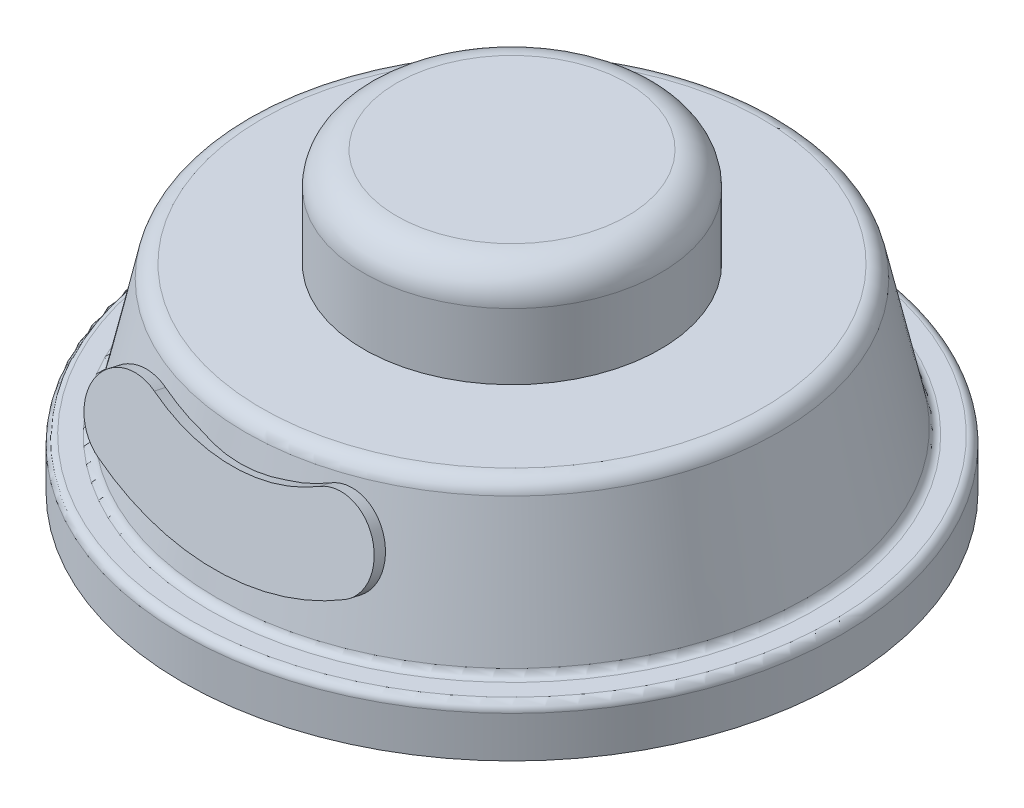
ISO-10303-21;
HEADER;
FILE_DESCRIPTION(('STEP AP214'),'2;1');
FILE_NAME('part.step','',(''),(''),'','','');
FILE_SCHEMA(('AUTOMOTIVE_DESIGN { 1 0 10303 214 1 1 1 1 }'));
ENDSEC;
DATA;
#1=APPLICATION_CONTEXT('core data for automotive mechanical design processes');
#2=APPLICATION_PROTOCOL_DEFINITION('international standard','automotive_design',2000,#1);
#3=PRODUCT_CONTEXT('',#1,'mechanical');
#4=PRODUCT('Part','Part','',(#3));
#5=PRODUCT_RELATED_PRODUCT_CATEGORY('part','',(#4));
#6=PRODUCT_DEFINITION_FORMATION('','',#4);
#7=PRODUCT_DEFINITION_CONTEXT('part definition',#1,'design');
#8=PRODUCT_DEFINITION('design','',#6,#7);
#9=PRODUCT_DEFINITION_SHAPE('','',#8);
#10=(LENGTH_UNIT() NAMED_UNIT(*) SI_UNIT(.MILLI.,.METRE.));
#11=(NAMED_UNIT(*) PLANE_ANGLE_UNIT() SI_UNIT($,.RADIAN.));
#12=(NAMED_UNIT(*) SI_UNIT($,.STERADIAN.) SOLID_ANGLE_UNIT());
#13=UNCERTAINTY_MEASURE_WITH_UNIT(LENGTH_MEASURE(1.E-05),#10,'distance_accuracy_value','');
#14=(GEOMETRIC_REPRESENTATION_CONTEXT(3) GLOBAL_UNCERTAINTY_ASSIGNED_CONTEXT((#13)) GLOBAL_UNIT_ASSIGNED_CONTEXT((#10,
#11,#12)) REPRESENTATION_CONTEXT('',''));
#15=CARTESIAN_POINT('',(0.,0.,0.));
#16=DIRECTION('',(0.,0.,1.));
#17=DIRECTION('',(1.,0.,0.));
#18=AXIS2_PLACEMENT_3D('',#15,#16,#17);
#19=CARTESIAN_POINT('',(0.,12.,0.));
#20=DIRECTION('',(0.,-1.,0.));
#21=DIRECTION('',(1.,0.,0.));
#22=AXIS2_PLACEMENT_3D('',#19,#20,#21);
#23=CONICAL_SURFACE('',#22,16.,0.218668945873942);
#24=CARTESIAN_POINT('',(0.,3.39153477109067,0.));
#25=DIRECTION('',(0.,-1.,0.));
#26=DIRECTION('',(1.,0.,0.));
#27=AXIS2_PLACEMENT_3D('',#24,#25,#26);
#28=CIRCLE('',#27,17.912992273091);
#29=CARTESIAN_POINT('',(17.912992273091,3.39153477109067,0.));
#30=VERTEX_POINT('',#29);
#31=EDGE_CURVE('E190',#30,#30,#28,.F.);
#32=ORIENTED_EDGE('',*,*,#31,.T.);
#33=EDGE_LOOP('',(#32));
#34=FACE_BOUND('',#33,.T.);
#35=CARTESIAN_POINT('',(0.,11.2169304578187,0.));
#36=DIRECTION('',(0.,1.,0.));
#37=DIRECTION('',(-1.,0.,0.));
#38=AXIS2_PLACEMENT_3D('',#35,#36,#37);
#39=CIRCLE('',#38,16.1740154538181);
#40=CARTESIAN_POINT('',(-16.1740154538181,11.2169304578187,0.));
#41=VERTEX_POINT('',#40);
#42=EDGE_CURVE('E174',#41,#41,#39,.F.);
#43=ORIENTED_EDGE('',*,*,#42,.T.);
#44=EDGE_LOOP('',(#43));
#45=FACE_BOUND('',#44,.T.);
#46=CARTESIAN_POINT('',(3.45720686361789,10.2609463358763,16.0176050975695));
#47=CARTESIAN_POINT('',(3.22773095311083,10.190057272501,16.0832826797373));
#48=CARTESIAN_POINT('',(2.99433926794827,10.1260580964333,16.1428638182956));
#49=CARTESIAN_POINT('',(2.52112889680109,10.0123754138582,16.2490494866227));
#50=CARTESIAN_POINT('',(2.28130821784729,9.9626964039865,16.2956499402082));
#51=CARTESIAN_POINT('',(1.79687206709386,9.87824938358092,16.3750348973591));
#52=CARTESIAN_POINT('',(1.55225824257946,9.84347634106428,16.4078240632983));
#53=CARTESIAN_POINT('',(1.05988646044738,9.78921709266682,16.4590498252578));
#54=CARTESIAN_POINT('',(0.812129003227727,9.76972848410186,16.4774886771168));
#55=CARTESIAN_POINT('',(0.314629284028566,9.74623760465022,16.49971950389));
#56=CARTESIAN_POINT('',(0.0648836988721862,9.74227235466804,16.5034764646369));
#57=CARTESIAN_POINT('',(-0.434149809180184,9.74997930873948,16.4961794089411));
#58=CARTESIAN_POINT('',(-0.683437730705828,9.76165155953904,16.485125348223));
#59=CARTESIAN_POINT('',(-1.17936425371395,9.80046197265399,16.4484314125975));
#60=CARTESIAN_POINT('',(-1.42600606172398,9.82757857024579,16.4228118753489));
#61=CARTESIAN_POINT('',(-1.91516139806947,9.89692986377701,16.3574611366622));
#62=CARTESIAN_POINT('',(-2.15767659570617,9.93915828665748,16.3177357907292));
#63=CARTESIAN_POINT('',(-2.57773209827146,10.0259930794598,16.2363423191294));
#64=CARTESIAN_POINT('',(-2.75650776368711,10.0674282324294,16.1975846708006));
#65=CARTESIAN_POINT('',(-3.10998040538967,10.1582705209238,16.1128895087882));
#66=CARTESIAN_POINT('',(-3.28468334005909,10.2076650486565,16.0669633536958));
#67=CARTESIAN_POINT('',(-3.4572068636179,10.2609463358763,16.0176050975695));
#68=B_SPLINE_CURVE_WITH_KNOTS('',3,(#46,#47,#48,#49,#50,#51,#52,#53,#54,#55,#56,#57,#58,#59,#60,
#61,#62,#63,#64,#65,#66,#67),.UNSPECIFIED.,.F.,.F.,(4,2,2,2,2,2,2,2,2,2,4),(0.,
0.746842280338755,1.49391881972158,2.24074296069528,2.98744967878112,3.73593610055249,
4.48442475981529,5.23187086809353,5.97900706377839,6.54135802095914,7.10282680579694),.UNSPECIFIED.);
#69=CARTESIAN_POINT('',(2.5871921997568,10.0296096672216,16.2329857526776));
#70=VERTEX_POINT('',#69);
#71=CARTESIAN_POINT('',(-2.58719219975712,10.0296096672036,16.2329857526816));
#72=VERTEX_POINT('',#71);
#73=EDGE_CURVE('E202',#70,#72,#68,.T.);
#74=ORIENTED_EDGE('',*,*,#73,.F.);
#75=CARTESIAN_POINT('',(2.56620948592745,11.2171304578187,15.969092243656));
#76=CARTESIAN_POINT('',(2.58511617900529,10.1509783472957,16.2060149348833));
#77=CARTESIAN_POINT('',(2.60382682751886,9.08482299252879,16.4429383470538));
#78=CARTESIAN_POINT('',(2.64085603536723,6.95250579739954,16.916786612638));
#79=CARTESIAN_POINT('',(2.65917459470309,5.88634395703725,17.1537114660519));
#80=CARTESIAN_POINT('',(2.67729710947575,4.82017887243097,17.3906370404088));
#81=B_SPLINE_CURVE_WITH_KNOTS('',3,(#75,#76,#77,#78,#79,#80),.UNSPECIFIED.,.F.,.F.,(4,2,4),(0.,
3.27696968080335,6.55393935271583),.UNSPECIFIED.);
#82=CARTESIAN_POINT('',(2.67333632537362,5.0529193591372,17.3389169322519));
#83=VERTEX_POINT('',#82);
#84=EDGE_CURVE('E11',#70,#83,#81,.T.);
#85=ORIENTED_EDGE('',*,*,#84,.T.);
#86=CARTESIAN_POINT('',(4.2295304120463,5.34301452262326,16.9598954433988));
#87=CARTESIAN_POINT('',(4.07347057118977,5.30691978604902,17.0070815601999));
#88=CARTESIAN_POINT('',(3.9162368452015,5.272720761438,17.0517793753009));
#89=CARTESIAN_POINT('',(3.599604741216,5.20822215826845,17.1360632979982));
#90=CARTESIAN_POINT('',(3.44020623589567,5.17792281017995,17.1756491034764));
#91=CARTESIAN_POINT('',(2.95903508901031,5.09303692521042,17.2865350481255));
#92=CARTESIAN_POINT('',(2.63431711137291,5.04446957992441,17.3499545246577));
#93=CARTESIAN_POINT('',(1.97923045692615,4.96416815328296,17.4547939259072));
#94=CARTESIAN_POINT('',(1.64886029403785,4.93243857138287,17.4962079702476));
#95=CARTESIAN_POINT('',(0.984900191580312,4.88634471966051,17.5563657788202));
#96=CARTESIAN_POINT('',(0.651310840074972,4.87197733654552,17.5751136074323));
#97=CARTESIAN_POINT('',(-0.0174115127870188,4.86082933082171,17.5896607655227));
#98=CARTESIAN_POINT('',(-0.352546298536016,4.86408834134669,17.5854083787709));
#99=CARTESIAN_POINT('',(-1.02109826176699,4.88823002751625,17.5539045070141));
#100=CARTESIAN_POINT('',(-1.35451542252561,4.90911287442728,17.5266527985044));
#101=CARTESIAN_POINT('',(-2.01643791533699,4.96808408516178,17.4496802860419));
#102=CARTESIAN_POINT('',(-2.34495237268438,5.00613483151191,17.4000086075522));
#103=CARTESIAN_POINT('',(-2.99543405512699,5.09880780574128,17.2789953690403));
#104=CARTESIAN_POINT('',(-3.31740485730414,5.15342070494255,17.20766600774));
#105=CARTESIAN_POINT('',(-3.73507016406784,5.23554386722165,17.1003614019209));
#106=CARTESIAN_POINT('',(-3.83464346728124,5.2559839889328,17.0736507974475));
#107=CARTESIAN_POINT('',(-4.03280728372045,5.2983721501383,17.0182518288246));
#108=CARTESIAN_POINT('',(-4.13139865229024,5.32031871609019,16.989565397257));
#109=CARTESIAN_POINT('',(-4.22953041204624,5.34301452262324,16.9598954433988));
#110=B_SPLINE_CURVE_WITH_KNOTS('',3,(#86,#87,#88,#89,#90,#91,#92,#93,#94,#95,#96,#97,#98,#99,
#100,#101,#102,#103,#104,#105,#106,#107,#108,#109),.UNSPECIFIED.,.F.,.F.,(4,2,2,2,2,2,2,2,2,2,2,
4),(0.,0.500887924560247,1.00180543790808,2.00373745954932,3.00593708687205,4.00795697866477,
5.01223085820295,6.01651449727399,7.01860820560968,8.02013852694744,8.33541683377483,
8.65039102591891),.UNSPECIFIED.);
#111=CARTESIAN_POINT('',(-2.67333632537362,5.0529193591372,17.3389169322519));
#112=VERTEX_POINT('',#111);
#113=EDGE_CURVE('E58',#83,#112,#110,.T.);
#114=ORIENTED_EDGE('',*,*,#113,.T.);
#115=CARTESIAN_POINT('',(-2.67729710947553,4.82017887243098,17.3906370404088));
#116=CARTESIAN_POINT('',(-2.65917459470295,5.88634395703726,17.1537114660519));
#117=CARTESIAN_POINT('',(-2.64085603536716,6.95250579739955,16.916786612638));
#118=CARTESIAN_POINT('',(-2.60382682751892,9.08482299252879,16.4429383470538));
#119=CARTESIAN_POINT('',(-2.58511617900542,10.1509783472957,16.2060149348833));
#120=CARTESIAN_POINT('',(-2.56620948592763,11.2171304578187,15.969092243656));
#121=B_SPLINE_CURVE_WITH_KNOTS('',3,(#115,#116,#117,#118,#119,#120),.UNSPECIFIED.,.F.,.F.,(4,2,
4),(0.,3.27696967191247,6.55393935271582),.UNSPECIFIED.);
#122=EDGE_CURVE('E194',#112,#72,#121,.T.);
#123=ORIENTED_EDGE('',*,*,#122,.T.);
#124=EDGE_LOOP('',(#74,#85,#114,#123));
#125=FACE_BOUND('',#124,.T.);
#126=ADVANCED_FACE('F43',(#34,#45,#125),#23,.T.);
#127=CARTESIAN_POINT('',(0.,3.,0.));
#128=DIRECTION('',(0.,-1.,0.));
#129=DIRECTION('',(0.,0.,-1.));
#130=AXIS2_PLACEMENT_3D('',#127,#128,#129);
#131=CYLINDRICAL_SURFACE('',#130,20.);
#132=CARTESIAN_POINT('',(0.,2.5,0.));
#133=DIRECTION('',(0.,1.,0.));
#134=DIRECTION('',(0.,0.,1.));
#135=AXIS2_PLACEMENT_3D('',#132,#133,#134);
#136=CIRCLE('',#135,20.);
#137=CARTESIAN_POINT('',(0.,2.5,20.));
#138=VERTEX_POINT('',#137);
#139=EDGE_CURVE('E186',#138,#138,#136,.F.);
#140=ORIENTED_EDGE('',*,*,#139,.T.);
#141=EDGE_LOOP('',(#140));
#142=FACE_BOUND('',#141,.T.);
#143=CARTESIAN_POINT('',(0.,0.,0.));
#144=DIRECTION('',(0.,1.,0.));
#145=DIRECTION('',(0.,0.,1.));
#146=AXIS2_PLACEMENT_3D('',#143,#144,#145);
#147=CIRCLE('',#146,20.);
#148=CARTESIAN_POINT('',(0.,0.,20.));
#149=VERTEX_POINT('',#148);
#150=EDGE_CURVE('E154',#149,#149,#147,.T.);
#151=ORIENTED_EDGE('',*,*,#150,.T.);
#152=EDGE_LOOP('',(#151));
#153=FACE_BOUND('',#152,.T.);
#154=ADVANCED_FACE('F272',(#142,#153),#131,.T.);
#155=CARTESIAN_POINT('',(0.,3.,0.));
#156=DIRECTION('',(0.,1.,0.));
#157=DIRECTION('',(0.,0.,1.));
#158=AXIS2_PLACEMENT_3D('',#155,#156,#157);
#159=PLANE('',#158);
#160=CARTESIAN_POINT('',(0.,3.,0.));
#161=DIRECTION('',(0.,1.,0.));
#162=DIRECTION('',(0.,0.,1.));
#163=AXIS2_PLACEMENT_3D('',#160,#161,#162);
#164=CIRCLE('',#163,19.5);
#165=CARTESIAN_POINT('',(0.,3.,19.5));
#166=VERTEX_POINT('',#165);
#167=EDGE_CURVE('E182',#166,#166,#164,.T.);
#168=ORIENTED_EDGE('',*,*,#167,.T.);
#169=EDGE_LOOP('',(#168));
#170=FACE_BOUND('',#169,.T.);
#171=CARTESIAN_POINT('',(0.,3.,0.));
#172=DIRECTION('',(0.,1.,0.));
#173=DIRECTION('',(0.,0.,1.));
#174=AXIS2_PLACEMENT_3D('',#171,#172,#173);
#175=CIRCLE('',#174,18.4010858031829);
#176=CARTESIAN_POINT('',(0.,3.,18.4010858031829));
#177=VERTEX_POINT('',#176);
#178=EDGE_CURVE('E178',#177,#177,#175,.F.);
#179=ORIENTED_EDGE('',*,*,#178,.T.);
#180=EDGE_LOOP('',(#179));
#181=FACE_BOUND('',#180,.T.);
#182=ADVANCED_FACE('F277',(#170,#181),#159,.T.);
#183=CARTESIAN_POINT('',(0.,0.,0.));
#184=DIRECTION('',(0.,1.,0.));
#185=DIRECTION('',(0.,0.,1.));
#186=AXIS2_PLACEMENT_3D('',#183,#184,#185);
#187=PLANE('',#186);
#188=CARTESIAN_POINT('',(0.,0.,0.));
#189=DIRECTION('',(0.,1.,0.));
#190=DIRECTION('',(0.,0.,1.));
#191=AXIS2_PLACEMENT_3D('',#188,#189,#190);
#192=CIRCLE('',#191,17.5);
#193=CARTESIAN_POINT('',(0.,0.,17.5));
#194=VERTEX_POINT('',#193);
#195=EDGE_CURVE('E146',#194,#194,#192,.T.);
#196=ORIENTED_EDGE('',*,*,#195,.T.);
#197=EDGE_LOOP('',(#196));
#198=FACE_BOUND('',#197,.T.);
#199=ORIENTED_EDGE('',*,*,#150,.F.);
#200=EDGE_LOOP('',(#199));
#201=FACE_BOUND('',#200,.T.);
#202=ADVANCED_FACE('F296',(#198,#201),#187,.F.);
#203=CARTESIAN_POINT('',(-16.,12.,0.));
#204=DIRECTION('',(0.,1.,0.));
#205=DIRECTION('',(-1.,0.,0.));
#206=AXIS2_PLACEMENT_3D('',#203,#204,#205);
#207=PLANE('',#206);
#208=CARTESIAN_POINT('',(0.,12.,0.));
#209=DIRECTION('',(0.,1.,0.));
#210=DIRECTION('',(-1.,0.,0.));
#211=AXIS2_PLACEMENT_3D('',#208,#209,#210);
#212=CIRCLE('',#211,15.1978283936341);
#213=CARTESIAN_POINT('',(-15.1978283936341,12.,0.));
#214=VERTEX_POINT('',#213);
#215=EDGE_CURVE('E170',#214,#214,#212,.T.);
#216=ORIENTED_EDGE('',*,*,#215,.T.);
#217=EDGE_LOOP('',(#216));
#218=FACE_BOUND('',#217,.T.);
#219=CARTESIAN_POINT('',(0.,12.,0.));
#220=DIRECTION('',(0.,1.,0.));
#221=DIRECTION('',(-1.,0.,0.));
#222=AXIS2_PLACEMENT_3D('',#219,#220,#221);
#223=CIRCLE('',#222,9.);
#224=CARTESIAN_POINT('',(-9.,12.,0.));
#225=VERTEX_POINT('',#224);
#226=EDGE_CURVE('E155',#225,#225,#223,.T.);
#227=ORIENTED_EDGE('',*,*,#226,.F.);
#228=EDGE_LOOP('',(#227));
#229=FACE_BOUND('',#228,.T.);
#230=ADVANCED_FACE('F292',(#218,#229),#207,.T.);
#231=CARTESIAN_POINT('',(0.,18.,0.));
#232=DIRECTION('',(0.,-1.,0.));
#233=DIRECTION('',(1.,0.,0.));
#234=AXIS2_PLACEMENT_3D('',#231,#232,#233);
#235=CYLINDRICAL_SURFACE('',#234,9.);
#236=CARTESIAN_POINT('',(0.,16.,0.));
#237=DIRECTION('',(0.,1.,0.));
#238=DIRECTION('',(-1.,0.,0.));
#239=AXIS2_PLACEMENT_3D('',#236,#237,#238);
#240=CIRCLE('',#239,9.);
#241=CARTESIAN_POINT('',(-9.,16.,0.));
#242=VERTEX_POINT('',#241);
#243=EDGE_CURVE('E166',#242,#242,#240,.F.);
#244=ORIENTED_EDGE('',*,*,#243,.T.);
#245=EDGE_LOOP('',(#244));
#246=FACE_BOUND('',#245,.T.);
#247=ORIENTED_EDGE('',*,*,#226,.T.);
#248=EDGE_LOOP('',(#247));
#249=FACE_BOUND('',#248,.T.);
#250=ADVANCED_FACE('F295',(#246,#249),#235,.T.);
#251=CARTESIAN_POINT('',(0.,18.,0.));
#252=DIRECTION('',(0.,1.,0.));
#253=DIRECTION('',(-1.,0.,0.));
#254=AXIS2_PLACEMENT_3D('',#251,#252,#253);
#255=PLANE('',#254);
#256=CARTESIAN_POINT('',(0.,18.,0.));
#257=DIRECTION('',(0.,1.,0.));
#258=DIRECTION('',(-1.,0.,0.));
#259=AXIS2_PLACEMENT_3D('',#256,#257,#258);
#260=CIRCLE('',#259,7.);
#261=CARTESIAN_POINT('',(-7.,18.,0.));
#262=VERTEX_POINT('',#261);
#263=EDGE_CURVE('E159',#262,#262,#260,.T.);
#264=ORIENTED_EDGE('',*,*,#263,.T.);
#265=EDGE_LOOP('',(#264));
#266=FACE_BOUND('',#265,.T.);
#267=ADVANCED_FACE('F300',(#266),#255,.T.);
#268=CARTESIAN_POINT('',(0.,16.,0.));
#269=DIRECTION('',(0.,1.,0.));
#270=DIRECTION('',(-1.,0.,0.));
#271=AXIS2_PLACEMENT_3D('',#268,#269,#270);
#272=TOROIDAL_SURFACE('',#271,7.,2.);
#273=ORIENTED_EDGE('',*,*,#243,.F.);
#274=EDGE_LOOP('',(#273));
#275=FACE_BOUND('',#274,.T.);
#276=ORIENTED_EDGE('',*,*,#263,.F.);
#277=EDGE_LOOP('',(#276));
#278=FACE_BOUND('',#277,.T.);
#279=ADVANCED_FACE('F288',(#275,#278),#272,.T.);
#280=CARTESIAN_POINT('',(0.,11.,0.));
#281=DIRECTION('',(0.,1.,0.));
#282=DIRECTION('',(-1.,0.,0.));
#283=AXIS2_PLACEMENT_3D('',#280,#281,#282);
#284=TOROIDAL_SURFACE('',#283,15.1978283936341,1.);
#285=ORIENTED_EDGE('',*,*,#42,.F.);
#286=EDGE_LOOP('',(#285));
#287=FACE_BOUND('',#286,.T.);
#288=ORIENTED_EDGE('',*,*,#215,.F.);
#289=EDGE_LOOP('',(#288));
#290=FACE_BOUND('',#289,.T.);
#291=ADVANCED_FACE('F284',(#287,#290),#284,.T.);
#292=CARTESIAN_POINT('',(0.,2.5,0.));
#293=DIRECTION('',(0.,1.,0.));
#294=DIRECTION('',(0.,0.,1.));
#295=AXIS2_PLACEMENT_3D('',#292,#293,#294);
#296=TOROIDAL_SURFACE('',#295,15.,2.5);
#297=CARTESIAN_POINT('',(0.,2.5,0.));
#298=DIRECTION('',(0.,1.,0.));
#299=DIRECTION('',(0.,0.,1.));
#300=AXIS2_PLACEMENT_3D('',#297,#298,#299);
#301=CIRCLE('',#300,17.5);
#302=CARTESIAN_POINT('',(0.,2.5,17.5));
#303=VERTEX_POINT('',#302);
#304=EDGE_CURVE('E150',#303,#303,#301,.T.);
#305=ORIENTED_EDGE('',*,*,#304,.F.);
#306=EDGE_LOOP('',(#305));
#307=FACE_BOUND('',#306,.T.);
#308=CARTESIAN_POINT('',(0.,0.603799418914525,0.));
#309=DIRECTION('',(0.,1.,0.));
#310=DIRECTION('',(0.,0.,1.));
#311=AXIS2_PLACEMENT_3D('',#308,#309,#310);
#312=CIRCLE('',#311,13.3707598837829);
#313=CARTESIAN_POINT('',(0.,0.603799418914525,13.3707598837829));
#314=VERTEX_POINT('',#313);
#315=EDGE_CURVE('E132',#314,#314,#312,.T.);
#316=ORIENTED_EDGE('',*,*,#315,.T.);
#317=EDGE_LOOP('',(#316));
#318=FACE_BOUND('',#317,.T.);
#319=ADVANCED_FACE('F287',(#307,#318),#296,.T.);
#320=CARTESIAN_POINT('',(0.,2.,0.));
#321=DIRECTION('',(0.,1.,0.));
#322=DIRECTION('',(0.,0.,1.));
#323=AXIS2_PLACEMENT_3D('',#320,#321,#322);
#324=CYLINDRICAL_SURFACE('',#323,17.5);
#325=ORIENTED_EDGE('',*,*,#304,.T.);
#326=EDGE_LOOP('',(#325));
#327=FACE_BOUND('',#326,.T.);
#328=ORIENTED_EDGE('',*,*,#195,.F.);
#329=EDGE_LOOP('',(#328));
#330=FACE_BOUND('',#329,.T.);
#331=ADVANCED_FACE('F311',(#327,#330),#324,.F.);
#332=CARTESIAN_POINT('',(0.,36.0833333333333,0.));
#333=DIRECTION('',(0.,1.,0.));
#334=DIRECTION('',(-1.,0.,0.));
#335=AXIS2_PLACEMENT_3D('',#332,#333,#334);
#336=SPHERICAL_SURFACE('',#335,34.0833333333333);
#337=CARTESIAN_POINT('',(0.,3.5,0.));
#338=DIRECTION('',(0.,1.,0.));
#339=DIRECTION('',(0.,0.,1.));
#340=AXIS2_PLACEMENT_3D('',#337,#338,#339);
#341=CIRCLE('',#340,10.);
#342=CARTESIAN_POINT('',(0.,3.5,10.));
#343=VERTEX_POINT('',#342);
#344=EDGE_CURVE('E137',#343,#343,#341,.T.);
#345=ORIENTED_EDGE('',*,*,#344,.F.);
#346=EDGE_LOOP('',(#345));
#347=FACE_BOUND('',#346,.T.);
#348=ADVANCED_FACE('F314',(#347),#336,.T.);
#349=CARTESIAN_POINT('',(0.,0.603799418914525,0.));
#350=DIRECTION('',(0.,-1.,0.));
#351=DIRECTION('',(0.,0.,-1.));
#352=AXIS2_PLACEMENT_3D('',#349,#350,#351);
#353=CONICAL_SURFACE('',#352,13.3707598837829,0.860977920559409);
#354=ORIENTED_EDGE('',*,*,#344,.T.);
#355=EDGE_LOOP('',(#354));
#356=FACE_BOUND('',#355,.T.);
#357=ORIENTED_EDGE('',*,*,#315,.F.);
#358=EDGE_LOOP('',(#357));
#359=FACE_BOUND('',#358,.T.);
#360=ADVANCED_FACE('F231',(#356,#359),#353,.F.);
#361=CARTESIAN_POINT('',(0.,2.5,0.));
#362=DIRECTION('',(0.,1.,0.));
#363=DIRECTION('',(0.,0.,1.));
#364=AXIS2_PLACEMENT_3D('',#361,#362,#363);
#365=TOROIDAL_SURFACE('',#364,19.5,0.5);
#366=ORIENTED_EDGE('',*,*,#139,.F.);
#367=EDGE_LOOP('',(#366));
#368=FACE_BOUND('',#367,.T.);
#369=ORIENTED_EDGE('',*,*,#167,.F.);
#370=EDGE_LOOP('',(#369));
#371=FACE_BOUND('',#370,.T.);
#372=ADVANCED_FACE('F269',(#368,#371),#365,.T.);
#373=CARTESIAN_POINT('',(0.,3.5,0.));
#374=DIRECTION('',(0.,1.,0.));
#375=DIRECTION('',(0.,0.,1.));
#376=AXIS2_PLACEMENT_3D('',#373,#374,#375);
#377=TOROIDAL_SURFACE('',#376,18.4010858031829,0.5);
#378=ORIENTED_EDGE('',*,*,#178,.F.);
#379=EDGE_LOOP('',(#378));
#380=FACE_BOUND('',#379,.T.);
#381=ORIENTED_EDGE('',*,*,#31,.F.);
#382=EDGE_LOOP('',(#381));
#383=FACE_BOUND('',#382,.T.);
#384=ADVANCED_FACE('F45',(#380,#383),#377,.F.);
#385=CARTESIAN_POINT('',(0.,3.90955508490685,17.5929978820809));
#386=DIRECTION('',(0.,0.216930457818656,0.976187060183953));
#387=DIRECTION('',(0.,-0.976187060183953,0.216930457818656));
#388=AXIS2_PLACEMENT_3D('',#385,#386,#387);
#389=PLANE('',#388);
#390=ORIENTED_EDGE('',*,*,#84,.F.);
#391=CARTESIAN_POINT('',(0.,19.580143320201,14.1106449409044));
#392=DIRECTION('',(0.,0.216930457818656,0.976187060183953));
#393=DIRECTION('',(0.,-0.976187060183953,0.216930457818656));
#394=AXIS2_PLACEMENT_3D('',#391,#392,#393);
#395=CIRCLE('',#394,10.1198116117095);
#396=CARTESIAN_POINT('',(5.011867412862,10.9979226152079,16.0178050975695));
#397=VERTEX_POINT('',#396);
#398=EDGE_CURVE('E242',#70,#397,#395,.T.);
#399=ORIENTED_EDGE('',*,*,#398,.T.);
#400=CARTESIAN_POINT('',(6.25,8.87776933709184,16.4889502704842));
#401=DIRECTION('',(0.,0.216930457818656,0.976187060183953));
#402=DIRECTION('',(0.,-0.976187060183953,0.216930457818656));
#403=AXIS2_PLACEMENT_3D('',#400,#401,#402);
#404=CIRCLE('',#403,2.5);
#405=CARTESIAN_POINT('',(7.48813258713799,6.75761605897581,16.9600954433989));
#406=VERTEX_POINT('',#405);
#407=EDGE_CURVE('E248',#406,#397,#404,.T.);
#408=ORIENTED_EDGE('',*,*,#407,.F.);
#409=CARTESIAN_POINT('',(0.,19.580143320201,14.1106449409044));
#410=DIRECTION('',(0.,0.216930457818656,0.976187060183953));
#411=DIRECTION('',(0.,-0.976187060183953,0.216930457818656));
#412=AXIS2_PLACEMENT_3D('',#409,#410,#411);
#413=CIRCLE('',#412,15.1198116117095);
#414=EDGE_CURVE('E129',#83,#406,#413,.T.);
#415=ORIENTED_EDGE('',*,*,#414,.F.);
#416=EDGE_LOOP('',(#390,#399,#408,#415));
#417=FACE_BOUND('',#416,.T.);
#418=ADVANCED_FACE('F216',(#417),#389,.F.);
#419=CARTESIAN_POINT('',(0.,19.731994640674,14.7939758830332));
#420=DIRECTION('',(0.,-0.216930457818656,-0.976187060183953));
#421=DIRECTION('',(0.,0.976187060183953,-0.216930457818656));
#422=AXIS2_PLACEMENT_3D('',#419,#420,#421);
#423=CYLINDRICAL_SURFACE('',#422,15.1198116117095);
#424=ORIENTED_EDGE('',*,*,#113,.F.);
#425=ORIENTED_EDGE('',*,*,#414,.T.);
#426=DIRECTION('',(0.,-0.216930457818656,-0.976187060183953));
#427=VECTOR('',#426,1.);
#428=CARTESIAN_POINT('',(7.48813258713799,6.90946737944887,17.6434263855276));
#429=LINE('',#428,#427);
#430=CARTESIAN_POINT('',(7.48813258713799,6.90946737944887,17.6434263855276));
#431=VERTEX_POINT('',#430);
#432=EDGE_CURVE('E108',#431,#406,#429,.T.);
#433=ORIENTED_EDGE('',*,*,#432,.F.);
#434=CARTESIAN_POINT('',(0.,19.731994640674,14.7939758830332));
#435=DIRECTION('',(0.,0.216930457818656,0.976187060183953));
#436=DIRECTION('',(0.,-0.976187060183953,0.216930457818656));
#437=AXIS2_PLACEMENT_3D('',#434,#435,#436);
#438=CIRCLE('',#437,15.1198116117095);
#439=CARTESIAN_POINT('',(-7.48813258713799,6.90946737944887,17.6434263855276));
#440=VERTEX_POINT('',#439);
#441=EDGE_CURVE('E116',#440,#431,#438,.T.);
#442=ORIENTED_EDGE('',*,*,#441,.F.);
#443=DIRECTION('',(0.,-0.216930457818656,-0.976187060183953));
#444=VECTOR('',#443,1.);
#445=CARTESIAN_POINT('',(-7.48813258713799,6.90946737944887,17.6434263855276));
#446=LINE('',#445,#444);
#447=CARTESIAN_POINT('',(-7.48813258713799,6.75761605897581,16.9600954433989));
#448=VERTEX_POINT('',#447);
#449=EDGE_CURVE('E246',#440,#448,#446,.T.);
#450=ORIENTED_EDGE('',*,*,#449,.T.);
#451=EDGE_CURVE('E245',#448,#112,#413,.T.);
#452=ORIENTED_EDGE('',*,*,#451,.T.);
#453=EDGE_LOOP('',(#424,#425,#433,#442,#450,#452));
#454=FACE_BOUND('',#453,.T.);
#455=ADVANCED_FACE('F128',(#454),#423,.T.);
#456=CARTESIAN_POINT('',(6.25,9.0296206575649,17.172281212613));
#457=DIRECTION('',(0.,-0.216930457818656,-0.976187060183953));
#458=DIRECTION('',(0.,0.976187060183953,-0.216930457818656));
#459=AXIS2_PLACEMENT_3D('',#456,#457,#458);
#460=CYLINDRICAL_SURFACE('',#459,2.5);
#461=ORIENTED_EDGE('',*,*,#407,.T.);
#462=DIRECTION('',(0.,-0.216930457818656,-0.976187060183953));
#463=VECTOR('',#462,1.);
#464=CARTESIAN_POINT('',(5.011867412862,11.1497739356809,16.7011360396983));
#465=LINE('',#464,#463);
#466=CARTESIAN_POINT('',(5.011867412862,11.1497739356809,16.7011360396983));
#467=VERTEX_POINT('',#466);
#468=EDGE_CURVE('E110',#467,#397,#465,.T.);
#469=ORIENTED_EDGE('',*,*,#468,.F.);
#470=CARTESIAN_POINT('',(6.25,9.0296206575649,17.172281212613));
#471=DIRECTION('',(0.,0.216930457818656,0.976187060183953));
#472=DIRECTION('',(0.,-0.976187060183953,0.216930457818656));
#473=AXIS2_PLACEMENT_3D('',#470,#471,#472);
#474=CIRCLE('',#473,2.5);
#475=EDGE_CURVE('E103',#431,#467,#474,.T.);
#476=ORIENTED_EDGE('',*,*,#475,.F.);
#477=ORIENTED_EDGE('',*,*,#432,.T.);
#478=EDGE_LOOP('',(#461,#469,#476,#477));
#479=FACE_BOUND('',#478,.T.);
#480=ADVANCED_FACE('F106',(#479),#460,.T.);
#481=CARTESIAN_POINT('',(0.,19.731994640674,14.7939758830332));
#482=DIRECTION('',(0.,-0.216930457818656,-0.976187060183953));
#483=DIRECTION('',(0.,0.976187060183953,-0.216930457818656));
#484=AXIS2_PLACEMENT_3D('',#481,#482,#483);
#485=CYLINDRICAL_SURFACE('',#484,10.1198116117095);
#486=ORIENTED_EDGE('',*,*,#398,.F.);
#487=ORIENTED_EDGE('',*,*,#73,.T.);
#488=CARTESIAN_POINT('',(-5.01186741286201,10.9979226152079,16.0178050975695));
#489=VERTEX_POINT('',#488);
#490=EDGE_CURVE('E65',#489,#72,#395,.T.);
#491=ORIENTED_EDGE('',*,*,#490,.F.);
#492=DIRECTION('',(0.,-0.216930457818656,-0.976187060183953));
#493=VECTOR('',#492,1.);
#494=CARTESIAN_POINT('',(-5.01186741286201,11.1497739356809,16.7011360396983));
#495=LINE('',#494,#493);
#496=CARTESIAN_POINT('',(-5.01186741286201,11.1497739356809,16.7011360396983));
#497=VERTEX_POINT('',#496);
#498=EDGE_CURVE('E139',#497,#489,#495,.T.);
#499=ORIENTED_EDGE('',*,*,#498,.F.);
#500=CARTESIAN_POINT('',(0.,19.731994640674,14.7939758830332));
#501=DIRECTION('',(0.,0.216930457818656,0.976187060183953));
#502=DIRECTION('',(0.,-0.976187060183953,0.216930457818656));
#503=AXIS2_PLACEMENT_3D('',#500,#501,#502);
#504=CIRCLE('',#503,10.1198116117095);
#505=EDGE_CURVE('E115',#497,#467,#504,.T.);
#506=ORIENTED_EDGE('',*,*,#505,.T.);
#507=ORIENTED_EDGE('',*,*,#468,.T.);
#508=EDGE_LOOP('',(#486,#487,#491,#499,#506,#507));
#509=FACE_BOUND('',#508,.T.);
#510=ADVANCED_FACE('F220',(#509),#485,.F.);
#511=CARTESIAN_POINT('',(-6.25,9.0296206575649,17.172281212613));
#512=DIRECTION('',(0.,-0.216930457818656,-0.976187060183953));
#513=DIRECTION('',(0.,0.976187060183953,-0.216930457818656));
#514=AXIS2_PLACEMENT_3D('',#511,#512,#513);
#515=CYLINDRICAL_SURFACE('',#514,2.5);
#516=CARTESIAN_POINT('',(-6.25,8.87776933709184,16.4889502704842));
#517=DIRECTION('',(0.,0.216930457818656,0.976187060183953));
#518=DIRECTION('',(0.,-0.976187060183953,0.216930457818656));
#519=AXIS2_PLACEMENT_3D('',#516,#517,#518);
#520=CIRCLE('',#519,2.5);
#521=EDGE_CURVE('E126',#489,#448,#520,.T.);
#522=ORIENTED_EDGE('',*,*,#521,.T.);
#523=ORIENTED_EDGE('',*,*,#449,.F.);
#524=CARTESIAN_POINT('',(-6.25,9.0296206575649,17.172281212613));
#525=DIRECTION('',(0.,0.216930457818656,0.976187060183953));
#526=DIRECTION('',(0.,-0.976187060183953,0.216930457818656));
#527=AXIS2_PLACEMENT_3D('',#524,#525,#526);
#528=CIRCLE('',#527,2.5);
#529=EDGE_CURVE('E121',#497,#440,#528,.T.);
#530=ORIENTED_EDGE('',*,*,#529,.F.);
#531=ORIENTED_EDGE('',*,*,#498,.T.);
#532=EDGE_LOOP('',(#522,#523,#530,#531));
#533=FACE_BOUND('',#532,.T.);
#534=ADVANCED_FACE('F217',(#533),#515,.T.);
#535=CARTESIAN_POINT('',(0.,4.06140640537991,18.2763288242096));
#536=DIRECTION('',(0.,0.216930457818656,0.976187060183953));
#537=DIRECTION('',(0.,-0.976187060183953,0.216930457818656));
#538=AXIS2_PLACEMENT_3D('',#535,#536,#537);
#539=PLANE('',#538);
#540=ORIENTED_EDGE('',*,*,#441,.T.);
#541=ORIENTED_EDGE('',*,*,#475,.T.);
#542=ORIENTED_EDGE('',*,*,#505,.F.);
#543=ORIENTED_EDGE('',*,*,#529,.T.);
#544=EDGE_LOOP('',(#540,#541,#542,#543));
#545=FACE_BOUND('',#544,.T.);
#546=ADVANCED_FACE('F119',(#545),#539,.T.);
#547=ORIENTED_EDGE('',*,*,#122,.F.);
#548=ORIENTED_EDGE('',*,*,#451,.F.);
#549=ORIENTED_EDGE('',*,*,#521,.F.);
#550=ORIENTED_EDGE('',*,*,#490,.T.);
#551=EDGE_LOOP('',(#547,#548,#549,#550));
#552=FACE_BOUND('',#551,.T.);
#553=ADVANCED_FACE('F211',(#552),#389,.F.);
#554=CLOSED_SHELL('',(#126,#154,#182,#202,#230,#250,#267,#279,#291,#319,#331,#348,#360,#372,
#384,#418,#455,#480,#510,#534,#546,#553));
#555=MANIFOLD_SOLID_BREP('B2',#554);
#556=ADVANCED_BREP_SHAPE_REPRESENTATION('',(#18,#555),#14);
#557=SHAPE_DEFINITION_REPRESENTATION(#9,#556);
ENDSEC;
END-ISO-10303-21;
